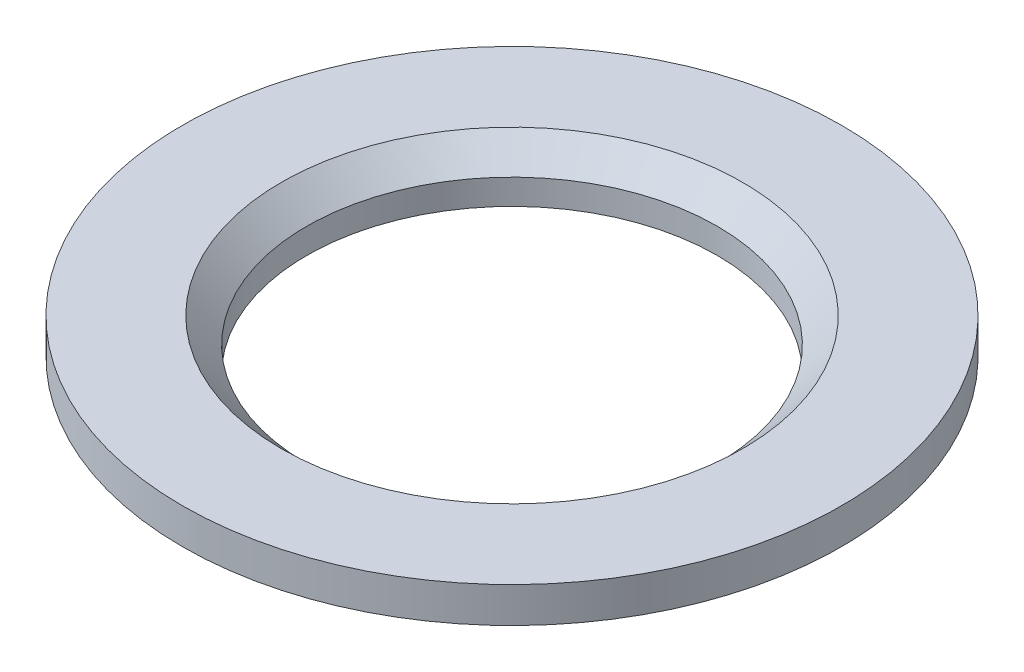
ISO-10303-21;
HEADER;
FILE_DESCRIPTION(('STEP AP214'),'2;1');
FILE_NAME('part.step','',(''),(''),'','','');
FILE_SCHEMA(('AUTOMOTIVE_DESIGN { 1 0 10303 214 1 1 1 1 }'));
ENDSEC;
DATA;
#1=APPLICATION_CONTEXT('core data for automotive mechanical design processes');
#2=APPLICATION_PROTOCOL_DEFINITION('international standard','automotive_design',2000,#1);
#3=PRODUCT_CONTEXT('',#1,'mechanical');
#4=PRODUCT('Part','Part','',(#3));
#5=PRODUCT_RELATED_PRODUCT_CATEGORY('part','',(#4));
#6=PRODUCT_DEFINITION_FORMATION('','',#4);
#7=PRODUCT_DEFINITION_CONTEXT('part definition',#1,'design');
#8=PRODUCT_DEFINITION('design','',#6,#7);
#9=PRODUCT_DEFINITION_SHAPE('','',#8);
#10=(LENGTH_UNIT() NAMED_UNIT(*) SI_UNIT(.MILLI.,.METRE.));
#11=(NAMED_UNIT(*) PLANE_ANGLE_UNIT() SI_UNIT($,.RADIAN.));
#12=(NAMED_UNIT(*) SI_UNIT($,.STERADIAN.) SOLID_ANGLE_UNIT());
#13=UNCERTAINTY_MEASURE_WITH_UNIT(LENGTH_MEASURE(1.E-05),#10,'distance_accuracy_value','');
#14=(GEOMETRIC_REPRESENTATION_CONTEXT(3) GLOBAL_UNCERTAINTY_ASSIGNED_CONTEXT((#13)) GLOBAL_UNIT_ASSIGNED_CONTEXT((#10,
#11,#12)) REPRESENTATION_CONTEXT('',''));
#15=CARTESIAN_POINT('',(0.,0.,0.));
#16=DIRECTION('',(0.,0.,1.));
#17=DIRECTION('',(1.,0.,0.));
#18=AXIS2_PLACEMENT_3D('',#15,#16,#17);
#19=CARTESIAN_POINT('',(0.,2.76350308641975,0.));
#20=DIRECTION('',(0.,1.,0.));
#21=DIRECTION('',(0.,0.,1.));
#22=AXIS2_PLACEMENT_3D('',#19,#20,#21);
#23=CYLINDRICAL_SURFACE('',#22,4.05);
#24=CARTESIAN_POINT('',(0.,0.,0.));
#25=DIRECTION('',(0.,1.,0.));
#26=DIRECTION('',(0.,0.,1.));
#27=AXIS2_PLACEMENT_3D('',#24,#25,#26);
#28=CIRCLE('',#27,4.05);
#29=CARTESIAN_POINT('',(0.,0.,4.05));
#30=VERTEX_POINT('',#29);
#31=EDGE_CURVE('E68',#30,#30,#28,.T.);
#32=ORIENTED_EDGE('',*,*,#31,.F.);
#33=EDGE_LOOP('',(#32));
#34=FACE_BOUND('',#33,.T.);
#35=CARTESIAN_POINT('',(0.,0.5,0.));
#36=DIRECTION('',(0.,1.,0.));
#37=DIRECTION('',(0.,0.,1.));
#38=AXIS2_PLACEMENT_3D('',#35,#36,#37);
#39=CIRCLE('',#38,4.05);
#40=CARTESIAN_POINT('',(0.,0.5,4.05));
#41=VERTEX_POINT('',#40);
#42=EDGE_CURVE('E10',#41,#41,#39,.T.);
#43=ORIENTED_EDGE('',*,*,#42,.T.);
#44=EDGE_LOOP('',(#43));
#45=FACE_BOUND('',#44,.T.);
#46=ADVANCED_FACE('F37',(#34,#45),#23,.F.);
#47=CARTESIAN_POINT('',(0.,1.,0.));
#48=DIRECTION('',(0.,1.,0.));
#49=DIRECTION('',(0.,0.,1.));
#50=AXIS2_PLACEMENT_3D('',#47,#48,#49);
#51=CONICAL_SURFACE('',#50,4.55,0.785398163397448);
#52=ORIENTED_EDGE('',*,*,#42,.F.);
#53=EDGE_LOOP('',(#52));
#54=FACE_BOUND('',#53,.T.);
#55=CARTESIAN_POINT('',(0.,1.,0.));
#56=DIRECTION('',(0.,1.,0.));
#57=DIRECTION('',(0.,0.,1.));
#58=AXIS2_PLACEMENT_3D('',#55,#56,#57);
#59=CIRCLE('',#58,4.55);
#60=CARTESIAN_POINT('',(0.,1.,4.55));
#61=VERTEX_POINT('',#60);
#62=EDGE_CURVE('E44',#61,#61,#59,.T.);
#63=ORIENTED_EDGE('',*,*,#62,.T.);
#64=EDGE_LOOP('',(#63));
#65=FACE_BOUND('',#64,.T.);
#66=ADVANCED_FACE('F76',(#54,#65),#51,.F.);
#67=CARTESIAN_POINT('',(4.55,1.,0.));
#68=DIRECTION('',(0.,-1.,0.));
#69=DIRECTION('',(0.,0.,-1.));
#70=AXIS2_PLACEMENT_3D('',#67,#68,#69);
#71=PLANE('',#70);
#72=ORIENTED_EDGE('',*,*,#62,.F.);
#73=EDGE_LOOP('',(#72));
#74=FACE_BOUND('',#73,.T.);
#75=CARTESIAN_POINT('',(0.,1.,0.));
#76=DIRECTION('',(0.,1.,0.));
#77=DIRECTION('',(0.,0.,1.));
#78=AXIS2_PLACEMENT_3D('',#75,#76,#77);
#79=CIRCLE('',#78,6.5);
#80=CARTESIAN_POINT('',(0.,1.,6.5));
#81=VERTEX_POINT('',#80);
#82=EDGE_CURVE('E49',#81,#81,#79,.T.);
#83=ORIENTED_EDGE('',*,*,#82,.T.);
#84=EDGE_LOOP('',(#83));
#85=FACE_BOUND('',#84,.T.);
#86=ADVANCED_FACE('F80',(#74,#85),#71,.F.);
#87=CARTESIAN_POINT('',(0.,2.76350308641975,0.));
#88=DIRECTION('',(0.,1.,0.));
#89=DIRECTION('',(0.,0.,1.));
#90=AXIS2_PLACEMENT_3D('',#87,#88,#89);
#91=CYLINDRICAL_SURFACE('',#90,6.5);
#92=ORIENTED_EDGE('',*,*,#82,.F.);
#93=EDGE_LOOP('',(#92));
#94=FACE_BOUND('',#93,.T.);
#95=CARTESIAN_POINT('',(0.,0.3,0.));
#96=DIRECTION('',(0.,1.,0.));
#97=DIRECTION('',(0.,0.,1.));
#98=AXIS2_PLACEMENT_3D('',#95,#96,#97);
#99=CIRCLE('',#98,6.5);
#100=CARTESIAN_POINT('',(0.,0.3,6.5));
#101=VERTEX_POINT('',#100);
#102=EDGE_CURVE('E54',#101,#101,#99,.T.);
#103=ORIENTED_EDGE('',*,*,#102,.T.);
#104=EDGE_LOOP('',(#103));
#105=FACE_BOUND('',#104,.T.);
#106=ADVANCED_FACE('F85',(#94,#105),#91,.T.);
#107=CARTESIAN_POINT('',(6.5,0.3,0.));
#108=DIRECTION('',(0.,1.,0.));
#109=DIRECTION('',(0.,0.,1.));
#110=AXIS2_PLACEMENT_3D('',#107,#108,#109);
#111=PLANE('',#110);
#112=ORIENTED_EDGE('',*,*,#102,.F.);
#113=EDGE_LOOP('',(#112));
#114=FACE_BOUND('',#113,.T.);
#115=CARTESIAN_POINT('',(0.,0.3,0.));
#116=DIRECTION('',(0.,1.,0.));
#117=DIRECTION('',(0.,0.,1.));
#118=AXIS2_PLACEMENT_3D('',#115,#116,#117);
#119=CIRCLE('',#118,4.8);
#120=CARTESIAN_POINT('',(0.,0.3,4.8));
#121=VERTEX_POINT('',#120);
#122=EDGE_CURVE('E60',#121,#121,#119,.T.);
#123=ORIENTED_EDGE('',*,*,#122,.T.);
#124=EDGE_LOOP('',(#123));
#125=FACE_BOUND('',#124,.T.);
#126=ADVANCED_FACE('F91',(#114,#125),#111,.F.);
#127=CARTESIAN_POINT('',(0.,0.,0.));
#128=DIRECTION('',(0.,1.,0.));
#129=DIRECTION('',(0.,0.,1.));
#130=AXIS2_PLACEMENT_3D('',#127,#128,#129);
#131=CONICAL_SURFACE('',#130,4.5,0.785398163397448);
#132=ORIENTED_EDGE('',*,*,#122,.F.);
#133=EDGE_LOOP('',(#132));
#134=FACE_BOUND('',#133,.T.);
#135=CARTESIAN_POINT('',(0.,0.,0.));
#136=DIRECTION('',(0.,1.,0.));
#137=DIRECTION('',(0.,0.,1.));
#138=AXIS2_PLACEMENT_3D('',#135,#136,#137);
#139=CIRCLE('',#138,4.5);
#140=CARTESIAN_POINT('',(0.,0.,4.5));
#141=VERTEX_POINT('',#140);
#142=EDGE_CURVE('E64',#141,#141,#139,.T.);
#143=ORIENTED_EDGE('',*,*,#142,.T.);
#144=EDGE_LOOP('',(#143));
#145=FACE_BOUND('',#144,.T.);
#146=ADVANCED_FACE('F95',(#134,#145),#131,.T.);
#147=CARTESIAN_POINT('',(4.5,0.,0.));
#148=DIRECTION('',(0.,1.,0.));
#149=DIRECTION('',(0.,0.,1.));
#150=AXIS2_PLACEMENT_3D('',#147,#148,#149);
#151=PLANE('',#150);
#152=ORIENTED_EDGE('',*,*,#142,.F.);
#153=EDGE_LOOP('',(#152));
#154=FACE_BOUND('',#153,.T.);
#155=ORIENTED_EDGE('',*,*,#31,.T.);
#156=EDGE_LOOP('',(#155));
#157=FACE_BOUND('',#156,.T.);
#158=ADVANCED_FACE('F73',(#154,#157),#151,.F.);
#159=CLOSED_SHELL('',(#46,#66,#86,#106,#126,#146,#158));
#160=MANIFOLD_SOLID_BREP('B2',#159);
#161=ADVANCED_BREP_SHAPE_REPRESENTATION('',(#18,#160),#14);
#162=SHAPE_DEFINITION_REPRESENTATION(#9,#161);
ENDSEC;
END-ISO-10303-21;
